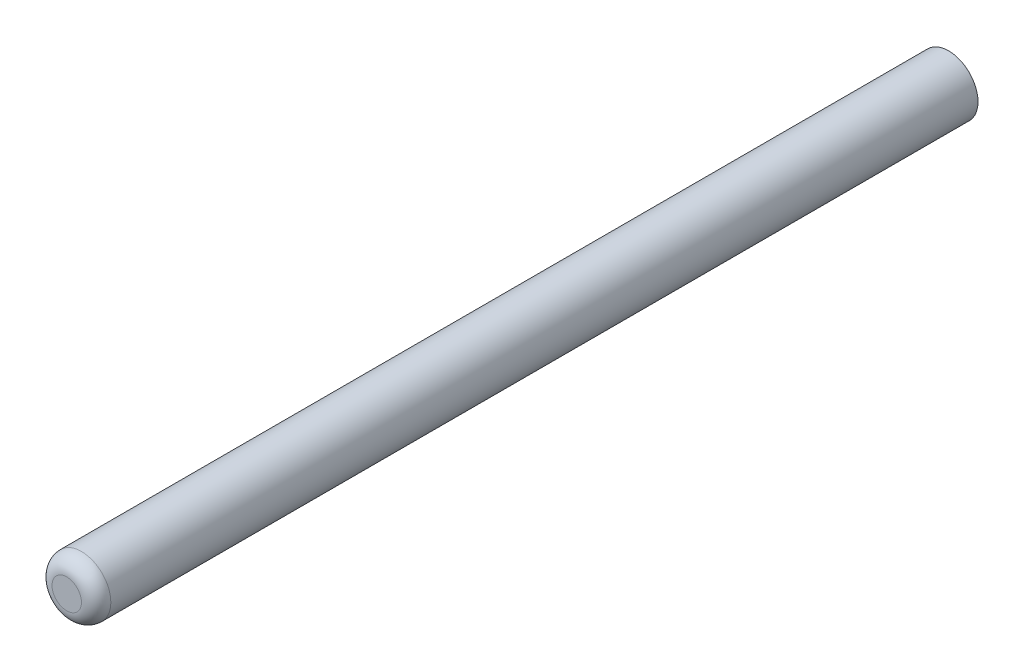
ISO-10303-21;
HEADER;
FILE_DESCRIPTION(('STEP AP214'),'2;1');
FILE_NAME('part.step','',(''),(''),'','','');
FILE_SCHEMA(('AUTOMOTIVE_DESIGN { 1 0 10303 214 1 1 1 1 }'));
ENDSEC;
DATA;
#1=APPLICATION_CONTEXT('core data for automotive mechanical design processes');
#2=APPLICATION_PROTOCOL_DEFINITION('international standard','automotive_design',2000,#1);
#3=PRODUCT_CONTEXT('',#1,'mechanical');
#4=PRODUCT('Part','Part','',(#3));
#5=PRODUCT_RELATED_PRODUCT_CATEGORY('part','',(#4));
#6=PRODUCT_DEFINITION_FORMATION('','',#4);
#7=PRODUCT_DEFINITION_CONTEXT('part definition',#1,'design');
#8=PRODUCT_DEFINITION('design','',#6,#7);
#9=PRODUCT_DEFINITION_SHAPE('','',#8);
#10=(LENGTH_UNIT() NAMED_UNIT(*) SI_UNIT(.MILLI.,.METRE.));
#11=(NAMED_UNIT(*) PLANE_ANGLE_UNIT() SI_UNIT($,.RADIAN.));
#12=(NAMED_UNIT(*) SI_UNIT($,.STERADIAN.) SOLID_ANGLE_UNIT());
#13=UNCERTAINTY_MEASURE_WITH_UNIT(LENGTH_MEASURE(1.E-05),#10,'distance_accuracy_value','');
#14=(GEOMETRIC_REPRESENTATION_CONTEXT(3) GLOBAL_UNCERTAINTY_ASSIGNED_CONTEXT((#13)) GLOBAL_UNIT_ASSIGNED_CONTEXT((#10,
#11,#12)) REPRESENTATION_CONTEXT('',''));
#15=CARTESIAN_POINT('',(0.,0.,0.));
#16=DIRECTION('',(0.,0.,1.));
#17=DIRECTION('',(1.,0.,0.));
#18=AXIS2_PLACEMENT_3D('',#15,#16,#17);
#19=CARTESIAN_POINT('',(0.,0.,300.));
#20=DIRECTION('',(0.,0.,-1.));
#21=DIRECTION('',(-1.,0.,0.));
#22=AXIS2_PLACEMENT_3D('',#19,#20,#21);
#23=CYLINDRICAL_SURFACE('',#22,10.);
#24=CARTESIAN_POINT('',(0.,0.,295.));
#25=DIRECTION('',(0.,0.,1.));
#26=DIRECTION('',(1.,0.,0.));
#27=AXIS2_PLACEMENT_3D('',#24,#25,#26);
#28=CIRCLE('',#27,10.);
#29=CARTESIAN_POINT('',(10.,0.,295.));
#30=VERTEX_POINT('',#29);
#31=EDGE_CURVE('E10',#30,#30,#28,.F.);
#32=ORIENTED_EDGE('',*,*,#31,.T.);
#33=EDGE_LOOP('',(#32));
#34=FACE_BOUND('',#33,.T.);
#35=CARTESIAN_POINT('',(0.,0.,0.));
#36=DIRECTION('',(0.,0.,1.));
#37=DIRECTION('',(1.,0.,0.));
#38=AXIS2_PLACEMENT_3D('',#35,#36,#37);
#39=CIRCLE('',#38,10.);
#40=CARTESIAN_POINT('',(10.,0.,0.));
#41=VERTEX_POINT('',#40);
#42=EDGE_CURVE('E42',#41,#41,#39,.T.);
#43=ORIENTED_EDGE('',*,*,#42,.T.);
#44=EDGE_LOOP('',(#43));
#45=FACE_BOUND('',#44,.T.);
#46=ADVANCED_FACE('F31',(#34,#45),#23,.T.);
#47=CARTESIAN_POINT('',(0.,0.,300.));
#48=DIRECTION('',(0.,0.,1.));
#49=DIRECTION('',(1.,0.,0.));
#50=AXIS2_PLACEMENT_3D('',#47,#48,#49);
#51=PLANE('',#50);
#52=CARTESIAN_POINT('',(0.,0.,300.));
#53=DIRECTION('',(0.,0.,1.));
#54=DIRECTION('',(1.,0.,0.));
#55=AXIS2_PLACEMENT_3D('',#52,#53,#54);
#56=CIRCLE('',#55,5.);
#57=CARTESIAN_POINT('',(5.,0.,300.));
#58=VERTEX_POINT('',#57);
#59=EDGE_CURVE('E38',#58,#58,#56,.T.);
#60=ORIENTED_EDGE('',*,*,#59,.T.);
#61=EDGE_LOOP('',(#60));
#62=FACE_BOUND('',#61,.T.);
#63=ADVANCED_FACE('F52',(#62),#51,.T.);
#64=CARTESIAN_POINT('',(0.,0.,0.));
#65=DIRECTION('',(0.,0.,1.));
#66=DIRECTION('',(1.,0.,0.));
#67=AXIS2_PLACEMENT_3D('',#64,#65,#66);
#68=PLANE('',#67);
#69=ORIENTED_EDGE('',*,*,#42,.F.);
#70=EDGE_LOOP('',(#69));
#71=FACE_BOUND('',#70,.T.);
#72=ADVANCED_FACE('F50',(#71),#68,.F.);
#73=CARTESIAN_POINT('',(0.,0.,295.));
#74=DIRECTION('',(0.,0.,1.));
#75=DIRECTION('',(1.,0.,0.));
#76=AXIS2_PLACEMENT_3D('',#73,#74,#75);
#77=DEGENERATE_TOROIDAL_SURFACE('',#76,5.,5.,.T.);
#78=ORIENTED_EDGE('',*,*,#31,.F.);
#79=EDGE_LOOP('',(#78));
#80=FACE_BOUND('',#79,.T.);
#81=ORIENTED_EDGE('',*,*,#59,.F.);
#82=EDGE_LOOP('',(#81));
#83=FACE_BOUND('',#82,.T.);
#84=ADVANCED_FACE('F33',(#80,#83),#77,.T.);
#85=CLOSED_SHELL('',(#46,#63,#72,#84));
#86=MANIFOLD_SOLID_BREP('B2',#85);
#87=ADVANCED_BREP_SHAPE_REPRESENTATION('',(#18,#86),#14);
#88=SHAPE_DEFINITION_REPRESENTATION(#9,#87);
ENDSEC;
END-ISO-10303-21;
